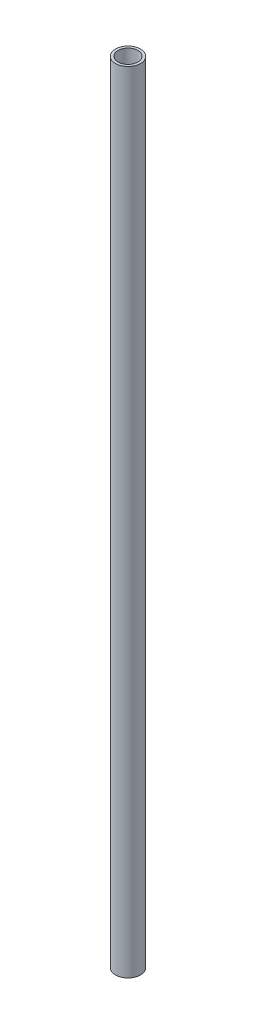
ISO-10303-21;
HEADER;
FILE_DESCRIPTION(('STEP AP214'),'2;1');
FILE_NAME('part.step','',(''),(''),'','','');
FILE_SCHEMA(('AUTOMOTIVE_DESIGN { 1 0 10303 214 1 1 1 1 }'));
ENDSEC;
DATA;
#1=APPLICATION_CONTEXT('core data for automotive mechanical design processes');
#2=APPLICATION_PROTOCOL_DEFINITION('international standard','automotive_design',2000,#1);
#3=PRODUCT_CONTEXT('',#1,'mechanical');
#4=PRODUCT('Part','Part','',(#3));
#5=PRODUCT_RELATED_PRODUCT_CATEGORY('part','',(#4));
#6=PRODUCT_DEFINITION_FORMATION('','',#4);
#7=PRODUCT_DEFINITION_CONTEXT('part definition',#1,'design');
#8=PRODUCT_DEFINITION('design','',#6,#7);
#9=PRODUCT_DEFINITION_SHAPE('','',#8);
#10=(LENGTH_UNIT() NAMED_UNIT(*) SI_UNIT(.MILLI.,.METRE.));
#11=(NAMED_UNIT(*) PLANE_ANGLE_UNIT() SI_UNIT($,.RADIAN.));
#12=(NAMED_UNIT(*) SI_UNIT($,.STERADIAN.) SOLID_ANGLE_UNIT());
#13=UNCERTAINTY_MEASURE_WITH_UNIT(LENGTH_MEASURE(1.E-05),#10,'distance_accuracy_value','');
#14=(GEOMETRIC_REPRESENTATION_CONTEXT(3) GLOBAL_UNCERTAINTY_ASSIGNED_CONTEXT((#13)) GLOBAL_UNIT_ASSIGNED_CONTEXT((#10,
#11,#12)) REPRESENTATION_CONTEXT('',''));
#15=CARTESIAN_POINT('',(0.,0.,0.));
#16=DIRECTION('',(0.,0.,1.));
#17=DIRECTION('',(1.,0.,0.));
#18=AXIS2_PLACEMENT_3D('',#15,#16,#17);
#19=CARTESIAN_POINT('',(0.,500.,0.));
#20=DIRECTION('',(0.,1.,0.));
#21=DIRECTION('',(0.,0.,1.));
#22=AXIS2_PLACEMENT_3D('',#19,#20,#21);
#23=PLANE('',#22);
#24=CARTESIAN_POINT('',(0.,500.,0.));
#25=DIRECTION('',(0.,1.,0.));
#26=DIRECTION('',(0.,0.,1.));
#27=AXIS2_PLACEMENT_3D('',#24,#25,#26);
#28=CIRCLE('',#27,7.9375);
#29=CARTESIAN_POINT('',(0.,500.,7.9375));
#30=VERTEX_POINT('',#29);
#31=EDGE_CURVE('E12',#30,#30,#28,.T.);
#32=ORIENTED_EDGE('',*,*,#31,.T.);
#33=EDGE_LOOP('',(#32));
#34=FACE_BOUND('',#33,.T.);
#35=CARTESIAN_POINT('',(0.,500.,0.));
#36=DIRECTION('',(0.,1.,0.));
#37=DIRECTION('',(0.,0.,1.));
#38=AXIS2_PLACEMENT_3D('',#35,#36,#37);
#39=CIRCLE('',#38,6.35);
#40=CARTESIAN_POINT('',(0.,500.,6.35));
#41=VERTEX_POINT('',#40);
#42=EDGE_CURVE('E51',#41,#41,#39,.T.);
#43=ORIENTED_EDGE('',*,*,#42,.F.);
#44=EDGE_LOOP('',(#43));
#45=FACE_BOUND('',#44,.T.);
#46=ADVANCED_FACE('F40',(#34,#45),#23,.T.);
#47=CARTESIAN_POINT('',(0.,0.,0.));
#48=DIRECTION('',(0.,1.,0.));
#49=DIRECTION('',(0.,0.,1.));
#50=AXIS2_PLACEMENT_3D('',#47,#48,#49);
#51=PLANE('',#50);
#52=CARTESIAN_POINT('',(0.,0.,0.));
#53=DIRECTION('',(0.,1.,0.));
#54=DIRECTION('',(0.,0.,1.));
#55=AXIS2_PLACEMENT_3D('',#52,#53,#54);
#56=CIRCLE('',#55,7.9375);
#57=CARTESIAN_POINT('',(0.,0.,7.9375));
#58=VERTEX_POINT('',#57);
#59=EDGE_CURVE('E44',#58,#58,#56,.T.);
#60=ORIENTED_EDGE('',*,*,#59,.F.);
#61=EDGE_LOOP('',(#60));
#62=FACE_BOUND('',#61,.T.);
#63=CARTESIAN_POINT('',(0.,0.,0.));
#64=DIRECTION('',(0.,1.,0.));
#65=DIRECTION('',(0.,0.,1.));
#66=AXIS2_PLACEMENT_3D('',#63,#64,#65);
#67=CIRCLE('',#66,6.35);
#68=CARTESIAN_POINT('',(0.,0.,6.35));
#69=VERTEX_POINT('',#68);
#70=EDGE_CURVE('E53',#69,#69,#67,.T.);
#71=ORIENTED_EDGE('',*,*,#70,.T.);
#72=EDGE_LOOP('',(#71));
#73=FACE_BOUND('',#72,.T.);
#74=ADVANCED_FACE('F63',(#62,#73),#51,.F.);
#75=CARTESIAN_POINT('',(0.,500.,0.));
#76=DIRECTION('',(0.,-1.,0.));
#77=DIRECTION('',(0.,0.,-1.));
#78=AXIS2_PLACEMENT_3D('',#75,#76,#77);
#79=CYLINDRICAL_SURFACE('',#78,7.9375);
#80=ORIENTED_EDGE('',*,*,#31,.F.);
#81=EDGE_LOOP('',(#80));
#82=FACE_BOUND('',#81,.T.);
#83=ORIENTED_EDGE('',*,*,#59,.T.);
#84=EDGE_LOOP('',(#83));
#85=FACE_BOUND('',#84,.T.);
#86=ADVANCED_FACE('F42',(#82,#85),#79,.T.);
#87=CARTESIAN_POINT('',(0.,500.,0.));
#88=DIRECTION('',(0.,-1.,0.));
#89=DIRECTION('',(0.,0.,-1.));
#90=AXIS2_PLACEMENT_3D('',#87,#88,#89);
#91=CYLINDRICAL_SURFACE('',#90,6.35);
#92=ORIENTED_EDGE('',*,*,#42,.T.);
#93=EDGE_LOOP('',(#92));
#94=FACE_BOUND('',#93,.T.);
#95=ORIENTED_EDGE('',*,*,#70,.F.);
#96=EDGE_LOOP('',(#95));
#97=FACE_BOUND('',#96,.T.);
#98=ADVANCED_FACE('F59',(#94,#97),#91,.F.);
#99=CLOSED_SHELL('',(#46,#74,#86,#98));
#100=MANIFOLD_SOLID_BREP('B2',#99);
#101=ADVANCED_BREP_SHAPE_REPRESENTATION('',(#18,#100),#14);
#102=SHAPE_DEFINITION_REPRESENTATION(#9,#101);
ENDSEC;
END-ISO-10303-21;
